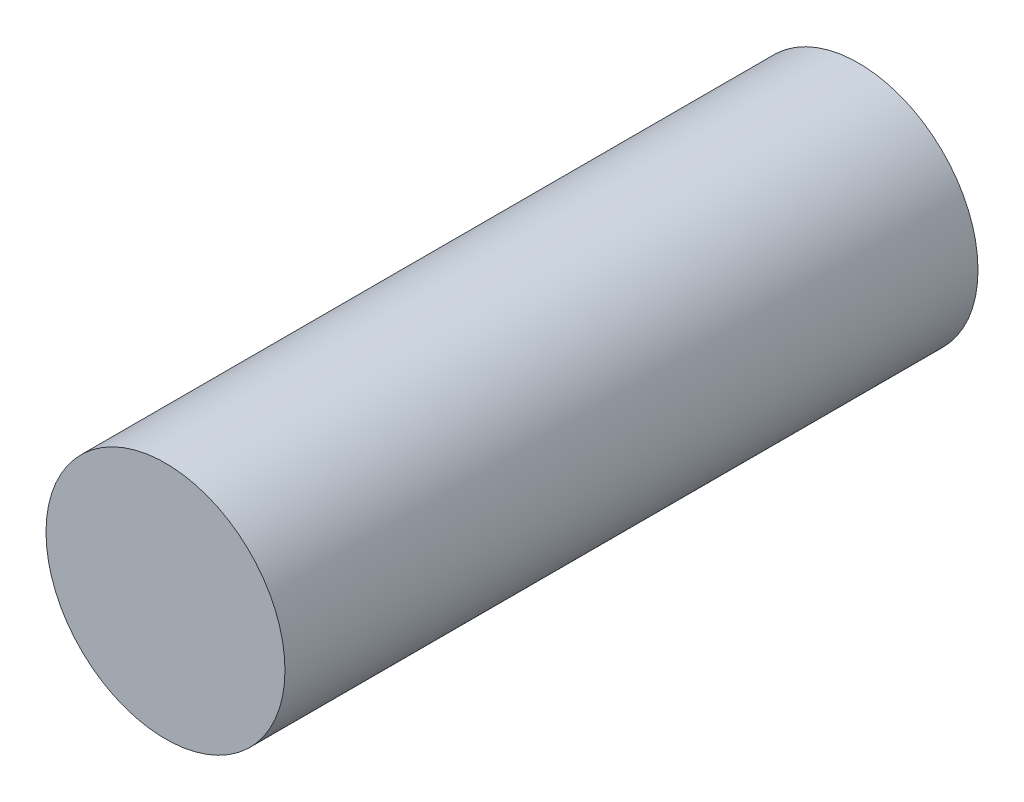
ISO-10303-21;
HEADER;
FILE_DESCRIPTION(('STEP AP214'),'2;1');
FILE_NAME('part.step','',(''),(''),'','','');
FILE_SCHEMA(('AUTOMOTIVE_DESIGN { 1 0 10303 214 1 1 1 1 }'));
ENDSEC;
DATA;
#1=APPLICATION_CONTEXT('core data for automotive mechanical design processes');
#2=APPLICATION_PROTOCOL_DEFINITION('international standard','automotive_design',2000,#1);
#3=PRODUCT_CONTEXT('',#1,'mechanical');
#4=PRODUCT('Part','Part','',(#3));
#5=PRODUCT_RELATED_PRODUCT_CATEGORY('part','',(#4));
#6=PRODUCT_DEFINITION_FORMATION('','',#4);
#7=PRODUCT_DEFINITION_CONTEXT('part definition',#1,'design');
#8=PRODUCT_DEFINITION('design','',#6,#7);
#9=PRODUCT_DEFINITION_SHAPE('','',#8);
#10=(LENGTH_UNIT() NAMED_UNIT(*) SI_UNIT(.MILLI.,.METRE.));
#11=(NAMED_UNIT(*) PLANE_ANGLE_UNIT() SI_UNIT($,.RADIAN.));
#12=(NAMED_UNIT(*) SI_UNIT($,.STERADIAN.) SOLID_ANGLE_UNIT());
#13=UNCERTAINTY_MEASURE_WITH_UNIT(LENGTH_MEASURE(1.E-05),#10,'distance_accuracy_value','');
#14=(GEOMETRIC_REPRESENTATION_CONTEXT(3) GLOBAL_UNCERTAINTY_ASSIGNED_CONTEXT((#13)) GLOBAL_UNIT_ASSIGNED_CONTEXT((#10,
#11,#12)) REPRESENTATION_CONTEXT('',''));
#15=CARTESIAN_POINT('',(0.,0.,0.));
#16=DIRECTION('',(0.,0.,1.));
#17=DIRECTION('',(1.,0.,0.));
#18=AXIS2_PLACEMENT_3D('',#15,#16,#17);
#19=CARTESIAN_POINT('',(0.0999998,0.,0.57999884));
#20=DIRECTION('',(0.,0.,-1.));
#21=DIRECTION('',(0.,-1.,0.));
#22=AXIS2_PLACEMENT_3D('',#19,#20,#21);
#23=PLANE('',#22);
#24=CARTESIAN_POINT('',(0.,0.,0.57999884));
#25=DIRECTION('',(0.,0.,1.));
#26=DIRECTION('',(1.,0.,0.));
#27=AXIS2_PLACEMENT_3D('',#24,#25,#26);
#28=CIRCLE('',#27,0.0999998);
#29=CARTESIAN_POINT('',(-0.0999998,0.,0.57999884));
#30=VERTEX_POINT('',#29);
#31=EDGE_CURVE('E11',#30,#30,#28,.T.);
#32=ORIENTED_EDGE('',*,*,#31,.T.);
#33=EDGE_LOOP('',(#32));
#34=FACE_BOUND('',#33,.T.);
#35=ADVANCED_FACE('F17',(#34),#23,.F.);
#36=CARTESIAN_POINT('',(0.0999998,0.,0.));
#37=DIRECTION('',(0.,0.,-1.));
#38=DIRECTION('',(0.,-1.,0.));
#39=AXIS2_PLACEMENT_3D('',#36,#37,#38);
#40=PLANE('',#39);
#41=CARTESIAN_POINT('',(0.,0.,0.));
#42=DIRECTION('',(0.,0.,1.));
#43=DIRECTION('',(1.,0.,0.));
#44=AXIS2_PLACEMENT_3D('',#41,#42,#43);
#45=CIRCLE('',#44,0.0999998);
#46=CARTESIAN_POINT('',(-0.0999998,0.,0.));
#47=VERTEX_POINT('',#46);
#48=EDGE_CURVE('E21',#47,#47,#45,.T.);
#49=ORIENTED_EDGE('',*,*,#48,.F.);
#50=EDGE_LOOP('',(#49));
#51=FACE_BOUND('',#50,.T.);
#52=ADVANCED_FACE('F19',(#51),#40,.T.);
#53=CARTESIAN_POINT('',(0.,0.,0.));
#54=DIRECTION('',(0.,0.,-1.));
#55=DIRECTION('',(1.,0.,0.));
#56=AXIS2_PLACEMENT_3D('',#53,#54,#55);
#57=CYLINDRICAL_SURFACE('',#56,0.0999998);
#58=ORIENTED_EDGE('',*,*,#48,.T.);
#59=DIRECTION('',(0.,0.,1.));
#60=VECTOR('',#59,1.);
#61=CARTESIAN_POINT('',(-0.0999998,0.,0.));
#62=LINE('',#61,#60);
#63=EDGE_CURVE('E27',#47,#30,#62,.T.);
#64=ORIENTED_EDGE('',*,*,#63,.T.);
#65=ORIENTED_EDGE('',*,*,#31,.F.);
#66=ORIENTED_EDGE('',*,*,#63,.F.);
#67=EDGE_LOOP('',(#58,#64,#65,#66));
#68=FACE_BOUND('',#67,.T.);
#69=ADVANCED_FACE('F42',(#68),#57,.T.);
#70=CLOSED_SHELL('',(#35,#52,#69));
#71=MANIFOLD_SOLID_BREP('B1',#70);
#72=ADVANCED_BREP_SHAPE_REPRESENTATION('',(#18,#71),#14);
#73=SHAPE_DEFINITION_REPRESENTATION(#9,#72);
ENDSEC;
END-ISO-10303-21;
